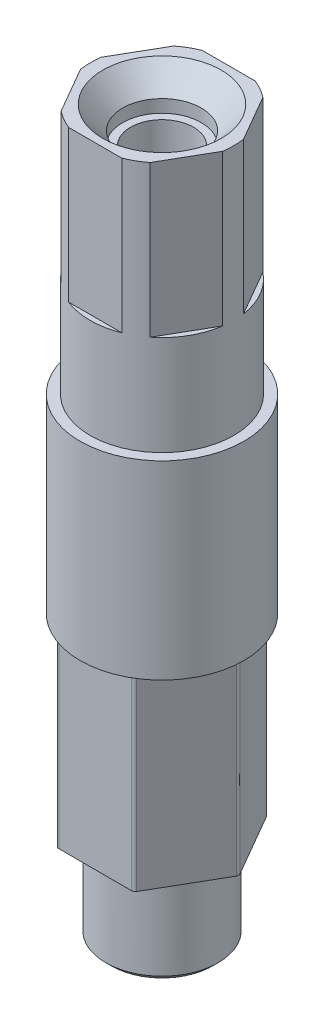
ISO-10303-21;
HEADER;
FILE_DESCRIPTION(('STEP AP214'),'2;1');
FILE_NAME('part.step','',(''),(''),'','','');
FILE_SCHEMA(('AUTOMOTIVE_DESIGN { 1 0 10303 214 1 1 1 1 }'));
ENDSEC;
DATA;
#1=APPLICATION_CONTEXT('core data for automotive mechanical design processes');
#2=APPLICATION_PROTOCOL_DEFINITION('international standard','automotive_design',2000,#1);
#3=PRODUCT_CONTEXT('',#1,'mechanical');
#4=PRODUCT('Part','Part','',(#3));
#5=PRODUCT_RELATED_PRODUCT_CATEGORY('part','',(#4));
#6=PRODUCT_DEFINITION_FORMATION('','',#4);
#7=PRODUCT_DEFINITION_CONTEXT('part definition',#1,'design');
#8=PRODUCT_DEFINITION('design','',#6,#7);
#9=PRODUCT_DEFINITION_SHAPE('','',#8);
#10=(LENGTH_UNIT() NAMED_UNIT(*) SI_UNIT(.MILLI.,.METRE.));
#11=(NAMED_UNIT(*) PLANE_ANGLE_UNIT() SI_UNIT($,.RADIAN.));
#12=(NAMED_UNIT(*) SI_UNIT($,.STERADIAN.) SOLID_ANGLE_UNIT());
#13=UNCERTAINTY_MEASURE_WITH_UNIT(LENGTH_MEASURE(1.E-05),#10,'distance_accuracy_value','');
#14=(GEOMETRIC_REPRESENTATION_CONTEXT(3) GLOBAL_UNCERTAINTY_ASSIGNED_CONTEXT((#13)) GLOBAL_UNIT_ASSIGNED_CONTEXT((#10,
#11,#12)) REPRESENTATION_CONTEXT('',''));
#15=CARTESIAN_POINT('',(0.,0.,0.));
#16=DIRECTION('',(0.,0.,1.));
#17=DIRECTION('',(1.,0.,0.));
#18=AXIS2_PLACEMENT_3D('',#15,#16,#17);
#19=CARTESIAN_POINT('',(0.,34.036,0.));
#20=DIRECTION('',(0.,1.,0.));
#21=DIRECTION('',(0.,0.,1.));
#22=AXIS2_PLACEMENT_3D('',#19,#20,#21);
#23=PLANE('',#22);
#24=CARTESIAN_POINT('',(0.,34.036,0.));
#25=DIRECTION('',(0.,1.,0.));
#26=DIRECTION('',(0.,0.,1.));
#27=AXIS2_PLACEMENT_3D('',#24,#25,#26);
#28=CIRCLE('',#27,5.842);
#29=CARTESIAN_POINT('',(0.,34.036,5.842));
#30=VERTEX_POINT('',#29);
#31=EDGE_CURVE('E406',#30,#30,#28,.T.);
#32=ORIENTED_EDGE('',*,*,#31,.T.);
#33=EDGE_LOOP('',(#32));
#34=FACE_BOUND('',#33,.T.);
#35=CARTESIAN_POINT('',(0.,34.036,0.));
#36=DIRECTION('',(0.,1.,0.));
#37=DIRECTION('',(0.,0.,1.));
#38=AXIS2_PLACEMENT_3D('',#35,#36,#37);
#39=CIRCLE('',#38,5.125);
#40=CARTESIAN_POINT('',(0.,34.036,5.125));
#41=VERTEX_POINT('',#40);
#42=EDGE_CURVE('E265',#41,#41,#39,.T.);
#43=ORIENTED_EDGE('',*,*,#42,.F.);
#44=EDGE_LOOP('',(#43));
#45=FACE_BOUND('',#44,.T.);
#46=ADVANCED_FACE('F16',(#34,#45),#23,.T.);
#47=CARTESIAN_POINT('',(2.7496306570156,52.705,4.7625));
#48=DIRECTION('',(-0.866025403784439,0.,-0.5));
#49=DIRECTION('',(-0.5,0.,0.866025403784439));
#50=AXIS2_PLACEMENT_3D('',#47,#48,#49);
#51=PLANE('',#50);
#52=DIRECTION('',(0.,1.,0.));
#53=VECTOR('',#52,1.);
#54=CARTESIAN_POINT('',(3.1778443335599,34.036,4.02081215572939));
#55=LINE('',#54,#53);
#56=CARTESIAN_POINT('',(3.1778443335599,41.148,4.02081215572939));
#57=VERTEX_POINT('',#56);
#58=CARTESIAN_POINT('',(3.1778443335599,51.943,4.02081215572939));
#59=VERTEX_POINT('',#58);
#60=EDGE_CURVE('E214',#57,#59,#55,.T.);
#61=ORIENTED_EDGE('',*,*,#60,.F.);
#62=DIRECTION('',(-0.5,0.,0.866025403784439));
#63=VECTOR('',#62,1.);
#64=CARTESIAN_POINT('',(3.1778443335599,41.148,4.02081215572938));
#65=LINE('',#64,#63);
#66=CARTESIAN_POINT('',(5.07104763748687,41.148,0.741687844270612));
#67=VERTEX_POINT('',#66);
#68=EDGE_CURVE('E569',#67,#57,#65,.T.);
#69=ORIENTED_EDGE('',*,*,#68,.F.);
#70=DIRECTION('',(0.,1.,0.));
#71=VECTOR('',#70,1.);
#72=CARTESIAN_POINT('',(5.07104763748687,34.036,0.741687844270614));
#73=LINE('',#72,#71);
#74=CARTESIAN_POINT('',(5.07104763748687,51.943,0.741687844270614));
#75=VERTEX_POINT('',#74);
#76=EDGE_CURVE('E211',#75,#67,#73,.F.);
#77=ORIENTED_EDGE('',*,*,#76,.F.);
#78=DIRECTION('',(0.5,0.,-0.866025403784439));
#79=VECTOR('',#78,1.);
#80=CARTESIAN_POINT('',(2.7496306570156,51.943,4.7625));
#81=LINE('',#80,#79);
#82=EDGE_CURVE('E216',#59,#75,#81,.T.);
#83=ORIENTED_EDGE('',*,*,#82,.F.);
#84=EDGE_LOOP('',(#61,#69,#77,#83));
#85=FACE_BOUND('',#84,.T.);
#86=ADVANCED_FACE('F452',(#85),#51,.F.);
#87=CARTESIAN_POINT('',(-2.74963065701559,52.705,4.7625));
#88=DIRECTION('',(0.,0.,-1.));
#89=DIRECTION('',(-1.,0.,0.));
#90=AXIS2_PLACEMENT_3D('',#87,#88,#89);
#91=PLANE('',#90);
#92=DIRECTION('',(0.,1.,0.));
#93=VECTOR('',#92,1.);
#94=CARTESIAN_POINT('',(-1.89320330392697,34.036,4.7625));
#95=LINE('',#94,#93);
#96=CARTESIAN_POINT('',(-1.89320330392697,41.148,4.7625));
#97=VERTEX_POINT('',#96);
#98=CARTESIAN_POINT('',(-1.89320330392697,51.943,4.7625));
#99=VERTEX_POINT('',#98);
#100=EDGE_CURVE('E209',#97,#99,#95,.T.);
#101=ORIENTED_EDGE('',*,*,#100,.F.);
#102=DIRECTION('',(-1.,0.,0.));
#103=VECTOR('',#102,1.);
#104=CARTESIAN_POINT('',(-1.89320330392697,41.148,4.7625));
#105=LINE('',#104,#103);
#106=CARTESIAN_POINT('',(1.89320330392697,41.148,4.7625));
#107=VERTEX_POINT('',#106);
#108=EDGE_CURVE('E557',#107,#97,#105,.T.);
#109=ORIENTED_EDGE('',*,*,#108,.F.);
#110=DIRECTION('',(0.,1.,0.));
#111=VECTOR('',#110,1.);
#112=CARTESIAN_POINT('',(1.89320330392697,34.036,4.7625));
#113=LINE('',#112,#111);
#114=CARTESIAN_POINT('',(1.89320330392697,51.943,4.7625));
#115=VERTEX_POINT('',#114);
#116=EDGE_CURVE('E201',#115,#107,#113,.F.);
#117=ORIENTED_EDGE('',*,*,#116,.F.);
#118=DIRECTION('',(1.,0.,0.));
#119=VECTOR('',#118,1.);
#120=CARTESIAN_POINT('',(-2.74963065701559,51.943,4.7625));
#121=LINE('',#120,#119);
#122=EDGE_CURVE('E233',#99,#115,#121,.T.);
#123=ORIENTED_EDGE('',*,*,#122,.F.);
#124=EDGE_LOOP('',(#101,#109,#117,#123));
#125=FACE_BOUND('',#124,.T.);
#126=ADVANCED_FACE('F459',(#125),#91,.F.);
#127=CARTESIAN_POINT('',(-5.49926131403119,52.705,0.));
#128=DIRECTION('',(0.866025403784439,0.,-0.5));
#129=DIRECTION('',(-0.5,0.,-0.866025403784439));
#130=AXIS2_PLACEMENT_3D('',#127,#128,#129);
#131=PLANE('',#130);
#132=DIRECTION('',(0.,1.,0.));
#133=VECTOR('',#132,1.);
#134=CARTESIAN_POINT('',(-5.07104763748687,34.036,0.741687844270612));
#135=LINE('',#134,#133);
#136=CARTESIAN_POINT('',(-5.07104763748687,41.148,0.741687844270612));
#137=VERTEX_POINT('',#136);
#138=CARTESIAN_POINT('',(-5.07104763748687,51.943,0.741687844270612));
#139=VERTEX_POINT('',#138);
#140=EDGE_CURVE('E193',#137,#139,#135,.T.);
#141=ORIENTED_EDGE('',*,*,#140,.F.);
#142=DIRECTION('',(-0.5,0.,-0.866025403784439));
#143=VECTOR('',#142,1.);
#144=CARTESIAN_POINT('',(-5.07104763748687,41.148,0.74168784427061));
#145=LINE('',#144,#143);
#146=CARTESIAN_POINT('',(-3.1778443335599,41.148,4.02081215572939));
#147=VERTEX_POINT('',#146);
#148=EDGE_CURVE('E182',#147,#137,#145,.T.);
#149=ORIENTED_EDGE('',*,*,#148,.F.);
#150=DIRECTION('',(0.,1.,0.));
#151=VECTOR('',#150,1.);
#152=CARTESIAN_POINT('',(-3.1778443335599,34.036,4.02081215572939));
#153=LINE('',#152,#151);
#154=CARTESIAN_POINT('',(-3.1778443335599,51.943,4.02081215572939));
#155=VERTEX_POINT('',#154);
#156=EDGE_CURVE('E191',#155,#147,#153,.F.);
#157=ORIENTED_EDGE('',*,*,#156,.F.);
#158=DIRECTION('',(0.5,0.,0.866025403784439));
#159=VECTOR('',#158,1.);
#160=CARTESIAN_POINT('',(-5.49926131403119,51.943,0.));
#161=LINE('',#160,#159);
#162=EDGE_CURVE('E236',#139,#155,#161,.T.);
#163=ORIENTED_EDGE('',*,*,#162,.F.);
#164=EDGE_LOOP('',(#141,#149,#157,#163));
#165=FACE_BOUND('',#164,.T.);
#166=ADVANCED_FACE('F189',(#165),#131,.F.);
#167=CARTESIAN_POINT('',(-2.74963065701559,52.705,-4.7625));
#168=DIRECTION('',(0.866025403784439,0.,0.5));
#169=DIRECTION('',(0.5,0.,-0.866025403784439));
#170=AXIS2_PLACEMENT_3D('',#167,#168,#169);
#171=PLANE('',#170);
#172=DIRECTION('',(0.,1.,0.));
#173=VECTOR('',#172,1.);
#174=CARTESIAN_POINT('',(-3.1778443335599,34.036,-4.02081215572939));
#175=LINE('',#174,#173);
#176=CARTESIAN_POINT('',(-3.1778443335599,41.148,-4.02081215572939));
#177=VERTEX_POINT('',#176);
#178=CARTESIAN_POINT('',(-3.1778443335599,51.943,-4.02081215572939));
#179=VERTEX_POINT('',#178);
#180=EDGE_CURVE('E199',#177,#179,#175,.T.);
#181=ORIENTED_EDGE('',*,*,#180,.F.);
#182=DIRECTION('',(0.5,0.,-0.866025403784439));
#183=VECTOR('',#182,1.);
#184=CARTESIAN_POINT('',(-3.1778443335599,41.148,-4.02081215572939));
#185=LINE('',#184,#183);
#186=CARTESIAN_POINT('',(-5.07104763748687,41.148,-0.741687844270614));
#187=VERTEX_POINT('',#186);
#188=EDGE_CURVE('E379',#187,#177,#185,.T.);
#189=ORIENTED_EDGE('',*,*,#188,.F.);
#190=DIRECTION('',(0.,1.,0.));
#191=VECTOR('',#190,1.);
#192=CARTESIAN_POINT('',(-5.07104763748687,34.036,-0.741687844270612));
#193=LINE('',#192,#191);
#194=CARTESIAN_POINT('',(-5.07104763748687,51.943,-0.741687844270611));
#195=VERTEX_POINT('',#194);
#196=EDGE_CURVE('E203',#195,#187,#193,.F.);
#197=ORIENTED_EDGE('',*,*,#196,.F.);
#198=DIRECTION('',(-0.5,0.,0.866025403784439));
#199=VECTOR('',#198,1.);
#200=CARTESIAN_POINT('',(-2.74963065701559,51.943,-4.7625));
#201=LINE('',#200,#199);
#202=EDGE_CURVE('E241',#179,#195,#201,.T.);
#203=ORIENTED_EDGE('',*,*,#202,.F.);
#204=EDGE_LOOP('',(#181,#189,#197,#203));
#205=FACE_BOUND('',#204,.T.);
#206=ADVANCED_FACE('F378',(#205),#171,.F.);
#207=CARTESIAN_POINT('',(2.74963065701559,52.705,-4.7625));
#208=DIRECTION('',(0.,0.,1.));
#209=DIRECTION('',(1.,0.,0.));
#210=AXIS2_PLACEMENT_3D('',#207,#208,#209);
#211=PLANE('',#210);
#212=DIRECTION('',(0.,1.,0.));
#213=VECTOR('',#212,1.);
#214=CARTESIAN_POINT('',(1.89320330392697,34.036,-4.7625));
#215=LINE('',#214,#213);
#216=CARTESIAN_POINT('',(1.89320330392697,41.148,-4.7625));
#217=VERTEX_POINT('',#216);
#218=CARTESIAN_POINT('',(1.89320330392697,51.943,-4.7625));
#219=VERTEX_POINT('',#218);
#220=EDGE_CURVE('E369',#217,#219,#215,.T.);
#221=ORIENTED_EDGE('',*,*,#220,.F.);
#222=DIRECTION('',(1.,0.,0.));
#223=VECTOR('',#222,1.);
#224=CARTESIAN_POINT('',(1.89320330392697,41.148,-4.7625));
#225=LINE('',#224,#223);
#226=CARTESIAN_POINT('',(-1.89320330392697,41.148,-4.7625));
#227=VERTEX_POINT('',#226);
#228=EDGE_CURVE('E347',#227,#217,#225,.T.);
#229=ORIENTED_EDGE('',*,*,#228,.F.);
#230=DIRECTION('',(0.,1.,0.));
#231=VECTOR('',#230,1.);
#232=CARTESIAN_POINT('',(-1.89320330392697,34.036,-4.7625));
#233=LINE('',#232,#231);
#234=CARTESIAN_POINT('',(-1.89320330392697,51.943,-4.7625));
#235=VERTEX_POINT('',#234);
#236=EDGE_CURVE('E366',#235,#227,#233,.F.);
#237=ORIENTED_EDGE('',*,*,#236,.F.);
#238=DIRECTION('',(-1.,0.,0.));
#239=VECTOR('',#238,1.);
#240=CARTESIAN_POINT('',(2.74963065701559,51.943,-4.7625));
#241=LINE('',#240,#239);
#242=EDGE_CURVE('E247',#219,#235,#241,.T.);
#243=ORIENTED_EDGE('',*,*,#242,.F.);
#244=EDGE_LOOP('',(#221,#229,#237,#243));
#245=FACE_BOUND('',#244,.T.);
#246=ADVANCED_FACE('F388',(#245),#211,.F.);
#247=CARTESIAN_POINT('',(5.49926131403119,52.705,0.));
#248=DIRECTION('',(-0.866025403784439,0.,0.5));
#249=DIRECTION('',(0.5,0.,0.866025403784439));
#250=AXIS2_PLACEMENT_3D('',#247,#248,#249);
#251=PLANE('',#250);
#252=DIRECTION('',(0.,1.,0.));
#253=VECTOR('',#252,1.);
#254=CARTESIAN_POINT('',(5.07104763748687,34.036,-0.741687844270618));
#255=LINE('',#254,#253);
#256=CARTESIAN_POINT('',(5.07104763748687,41.148,-0.741687844270615));
#257=VERTEX_POINT('',#256);
#258=CARTESIAN_POINT('',(5.07104763748687,51.943,-0.741687844270618));
#259=VERTEX_POINT('',#258);
#260=EDGE_CURVE('E220',#257,#259,#255,.T.);
#261=ORIENTED_EDGE('',*,*,#260,.F.);
#262=DIRECTION('',(0.5,0.,0.866025403784439));
#263=VECTOR('',#262,1.);
#264=CARTESIAN_POINT('',(5.07104763748687,41.148,-0.741687844270615));
#265=LINE('',#264,#263);
#266=CARTESIAN_POINT('',(3.1778443335599,41.148,-4.02081215572938));
#267=VERTEX_POINT('',#266);
#268=EDGE_CURVE('E392',#267,#257,#265,.T.);
#269=ORIENTED_EDGE('',*,*,#268,.F.);
#270=DIRECTION('',(0.,1.,0.));
#271=VECTOR('',#270,1.);
#272=CARTESIAN_POINT('',(3.1778443335599,34.036,-4.02081215572938));
#273=LINE('',#272,#271);
#274=CARTESIAN_POINT('',(3.1778443335599,51.943,-4.02081215572938));
#275=VERTEX_POINT('',#274);
#276=EDGE_CURVE('E217',#275,#267,#273,.F.);
#277=ORIENTED_EDGE('',*,*,#276,.F.);
#278=DIRECTION('',(-0.5,0.,-0.866025403784439));
#279=VECTOR('',#278,1.);
#280=CARTESIAN_POINT('',(5.49926131403119,51.943,0.));
#281=LINE('',#280,#279);
#282=EDGE_CURVE('E230',#259,#275,#281,.T.);
#283=ORIENTED_EDGE('',*,*,#282,.F.);
#284=EDGE_LOOP('',(#261,#269,#277,#283));
#285=FACE_BOUND('',#284,.T.);
#286=ADVANCED_FACE('F482',(#285),#251,.F.);
#287=CARTESIAN_POINT('',(0.,51.943,0.));
#288=DIRECTION('',(0.,1.,0.));
#289=DIRECTION('',(0.,0.,1.));
#290=AXIS2_PLACEMENT_3D('',#287,#288,#289);
#291=PLANE('',#290);
#292=CARTESIAN_POINT('',(0.,51.943,0.));
#293=DIRECTION('',(0.,1.,0.));
#294=DIRECTION('',(0.,0.,1.));
#295=AXIS2_PLACEMENT_3D('',#292,#293,#294);
#296=CIRCLE('',#295,4.22710350578403);
#297=CARTESIAN_POINT('',(0.,51.943,4.22710350578403));
#298=VERTEX_POINT('',#297);
#299=EDGE_CURVE('E221',#298,#298,#296,.F.);
#300=ORIENTED_EDGE('',*,*,#299,.T.);
#301=EDGE_LOOP('',(#300));
#302=FACE_BOUND('',#301,.T.);
#303=ORIENTED_EDGE('',*,*,#122,.T.);
#304=CARTESIAN_POINT('',(0.,51.943,0.));
#305=DIRECTION('',(0.,1.,0.));
#306=DIRECTION('',(0.,0.,1.));
#307=AXIS2_PLACEMENT_3D('',#304,#305,#306);
#308=CIRCLE('',#307,5.125);
#309=EDGE_CURVE('E260',#115,#59,#308,.T.);
#310=ORIENTED_EDGE('',*,*,#309,.T.);
#311=ORIENTED_EDGE('',*,*,#82,.T.);
#312=CARTESIAN_POINT('',(0.,51.943,0.));
#313=DIRECTION('',(0.,1.,0.));
#314=DIRECTION('',(0.,0.,1.));
#315=AXIS2_PLACEMENT_3D('',#312,#313,#314);
#316=CIRCLE('',#315,5.125);
#317=EDGE_CURVE('E255',#75,#259,#316,.T.);
#318=ORIENTED_EDGE('',*,*,#317,.T.);
#319=ORIENTED_EDGE('',*,*,#282,.T.);
#320=CARTESIAN_POINT('',(0.,51.943,0.));
#321=DIRECTION('',(0.,1.,0.));
#322=DIRECTION('',(0.,0.,1.));
#323=AXIS2_PLACEMENT_3D('',#320,#321,#322);
#324=CIRCLE('',#323,5.125);
#325=EDGE_CURVE('E250',#275,#219,#324,.T.);
#326=ORIENTED_EDGE('',*,*,#325,.T.);
#327=ORIENTED_EDGE('',*,*,#242,.T.);
#328=CARTESIAN_POINT('',(0.,51.943,0.));
#329=DIRECTION('',(0.,1.,0.));
#330=DIRECTION('',(0.,0.,1.));
#331=AXIS2_PLACEMENT_3D('',#328,#329,#330);
#332=CIRCLE('',#331,5.125);
#333=EDGE_CURVE('E244',#235,#179,#332,.T.);
#334=ORIENTED_EDGE('',*,*,#333,.T.);
#335=ORIENTED_EDGE('',*,*,#202,.T.);
#336=CARTESIAN_POINT('',(0.,51.943,0.));
#337=DIRECTION('',(0.,1.,0.));
#338=DIRECTION('',(0.,0.,1.));
#339=AXIS2_PLACEMENT_3D('',#336,#337,#338);
#340=CIRCLE('',#339,5.125);
#341=EDGE_CURVE('E238',#195,#139,#340,.T.);
#342=ORIENTED_EDGE('',*,*,#341,.T.);
#343=ORIENTED_EDGE('',*,*,#162,.T.);
#344=CARTESIAN_POINT('',(0.,51.943,0.));
#345=DIRECTION('',(0.,1.,0.));
#346=DIRECTION('',(0.,0.,1.));
#347=AXIS2_PLACEMENT_3D('',#344,#345,#346);
#348=CIRCLE('',#347,5.125);
#349=EDGE_CURVE('E198',#155,#99,#348,.T.);
#350=ORIENTED_EDGE('',*,*,#349,.T.);
#351=EDGE_LOOP('',(#303,#310,#311,#318,#319,#326,#327,#334,#335,#342,#343,#350));
#352=FACE_BOUND('',#351,.T.);
#353=ADVANCED_FACE('F381',(#302,#352),#291,.T.);
#354=CARTESIAN_POINT('',(0.,52.705,0.));
#355=DIRECTION('',(0.,1.,0.));
#356=DIRECTION('',(0.,0.,1.));
#357=AXIS2_PLACEMENT_3D('',#354,#355,#356);
#358=CONICAL_SURFACE('',#357,4.8895,0.715584993317676);
#359=CARTESIAN_POINT('',(0.,50.3090126814401,0.));
#360=DIRECTION('',(0.,1.,0.));
#361=DIRECTION('',(0.,0.,1.));
#362=AXIS2_PLACEMENT_3D('',#359,#360,#361);
#363=CIRCLE('',#362,2.8067);
#364=CARTESIAN_POINT('',(0.,50.3090126814401,2.8067));
#365=VERTEX_POINT('',#364);
#366=EDGE_CURVE('E266',#365,#365,#363,.F.);
#367=ORIENTED_EDGE('',*,*,#366,.T.);
#368=EDGE_LOOP('',(#367));
#369=FACE_BOUND('',#368,.T.);
#370=ORIENTED_EDGE('',*,*,#299,.F.);
#371=EDGE_LOOP('',(#370));
#372=FACE_BOUND('',#371,.T.);
#373=ADVANCED_FACE('F497',(#369,#372),#358,.F.);
#374=CARTESIAN_POINT('',(0.,34.036,0.));
#375=DIRECTION('',(0.,1.,0.));
#376=DIRECTION('',(0.,0.,1.));
#377=AXIS2_PLACEMENT_3D('',#374,#375,#376);
#378=CYLINDRICAL_SURFACE('',#377,5.125);
#379=ORIENTED_EDGE('',*,*,#42,.T.);
#380=EDGE_LOOP('',(#379));
#381=FACE_BOUND('',#380,.T.);
#382=ORIENTED_EDGE('',*,*,#156,.T.);
#383=CARTESIAN_POINT('',(0.,41.148,0.));
#384=DIRECTION('',(0.,1.,0.));
#385=DIRECTION('',(0.,0.,1.));
#386=AXIS2_PLACEMENT_3D('',#383,#384,#385);
#387=CIRCLE('',#386,5.125);
#388=EDGE_CURVE('E179',#137,#147,#387,.T.);
#389=ORIENTED_EDGE('',*,*,#388,.F.);
#390=ORIENTED_EDGE('',*,*,#140,.T.);
#391=ORIENTED_EDGE('',*,*,#341,.F.);
#392=ORIENTED_EDGE('',*,*,#196,.T.);
#393=CARTESIAN_POINT('',(0.,41.148,0.));
#394=DIRECTION('',(0.,1.,0.));
#395=DIRECTION('',(0.,0.,1.));
#396=AXIS2_PLACEMENT_3D('',#393,#394,#395);
#397=CIRCLE('',#396,5.125);
#398=EDGE_CURVE('E373',#177,#187,#397,.T.);
#399=ORIENTED_EDGE('',*,*,#398,.F.);
#400=ORIENTED_EDGE('',*,*,#180,.T.);
#401=ORIENTED_EDGE('',*,*,#333,.F.);
#402=ORIENTED_EDGE('',*,*,#236,.T.);
#403=CARTESIAN_POINT('',(0.,41.148,0.));
#404=DIRECTION('',(0.,1.,0.));
#405=DIRECTION('',(0.,0.,1.));
#406=AXIS2_PLACEMENT_3D('',#403,#404,#405);
#407=CIRCLE('',#406,5.125);
#408=EDGE_CURVE('E390',#217,#227,#407,.T.);
#409=ORIENTED_EDGE('',*,*,#408,.F.);
#410=ORIENTED_EDGE('',*,*,#220,.T.);
#411=ORIENTED_EDGE('',*,*,#325,.F.);
#412=ORIENTED_EDGE('',*,*,#276,.T.);
#413=CARTESIAN_POINT('',(0.,41.148,0.));
#414=DIRECTION('',(0.,1.,0.));
#415=DIRECTION('',(0.,0.,1.));
#416=AXIS2_PLACEMENT_3D('',#413,#414,#415);
#417=CIRCLE('',#416,5.125);
#418=EDGE_CURVE('E575',#257,#267,#417,.T.);
#419=ORIENTED_EDGE('',*,*,#418,.F.);
#420=ORIENTED_EDGE('',*,*,#260,.T.);
#421=ORIENTED_EDGE('',*,*,#317,.F.);
#422=ORIENTED_EDGE('',*,*,#76,.T.);
#423=CARTESIAN_POINT('',(0.,41.148,0.));
#424=DIRECTION('',(0.,1.,0.));
#425=DIRECTION('',(0.,0.,1.));
#426=AXIS2_PLACEMENT_3D('',#423,#424,#425);
#427=CIRCLE('',#426,5.125);
#428=EDGE_CURVE('E562',#57,#67,#427,.T.);
#429=ORIENTED_EDGE('',*,*,#428,.F.);
#430=ORIENTED_EDGE('',*,*,#60,.T.);
#431=ORIENTED_EDGE('',*,*,#309,.F.);
#432=ORIENTED_EDGE('',*,*,#116,.T.);
#433=CARTESIAN_POINT('',(0.,41.148,0.));
#434=DIRECTION('',(0.,1.,0.));
#435=DIRECTION('',(0.,0.,1.));
#436=AXIS2_PLACEMENT_3D('',#433,#434,#435);
#437=CIRCLE('',#436,5.125);
#438=EDGE_CURVE('E194',#97,#107,#437,.T.);
#439=ORIENTED_EDGE('',*,*,#438,.F.);
#440=ORIENTED_EDGE('',*,*,#100,.T.);
#441=ORIENTED_EDGE('',*,*,#349,.F.);
#442=EDGE_LOOP('',(#382,#389,#390,#391,#392,#399,#400,#401,#402,#409,#410,#411,#412,#419,#420,
#421,#422,#429,#430,#431,#432,#439,#440,#441));
#443=FACE_BOUND('',#442,.T.);
#444=ADVANCED_FACE('F196',(#381,#443),#378,.T.);
#445=CARTESIAN_POINT('',(0.,48.895,0.));
#446=DIRECTION('',(0.,1.,0.));
#447=DIRECTION('',(0.,0.,1.));
#448=AXIS2_PLACEMENT_3D('',#445,#446,#447);
#449=CYLINDRICAL_SURFACE('',#448,2.8067);
#450=CARTESIAN_POINT('',(0.,49.403,0.));
#451=DIRECTION('',(0.,1.,0.));
#452=DIRECTION('',(0.,0.,1.));
#453=AXIS2_PLACEMENT_3D('',#450,#451,#452);
#454=CIRCLE('',#453,2.8067);
#455=CARTESIAN_POINT('',(0.,49.403,2.8067));
#456=VERTEX_POINT('',#455);
#457=EDGE_CURVE('E271',#456,#456,#454,.T.);
#458=ORIENTED_EDGE('',*,*,#457,.F.);
#459=EDGE_LOOP('',(#458));
#460=FACE_BOUND('',#459,.T.);
#461=ORIENTED_EDGE('',*,*,#366,.F.);
#462=EDGE_LOOP('',(#461));
#463=FACE_BOUND('',#462,.T.);
#464=ADVANCED_FACE('F493',(#460,#463),#449,.F.);
#465=CARTESIAN_POINT('',(0.,49.403,0.));
#466=DIRECTION('',(0.,1.,0.));
#467=DIRECTION('',(0.,0.,1.));
#468=AXIS2_PLACEMENT_3D('',#465,#466,#467);
#469=PLANE('',#468);
#470=ORIENTED_EDGE('',*,*,#457,.T.);
#471=EDGE_LOOP('',(#470));
#472=FACE_BOUND('',#471,.T.);
#473=CARTESIAN_POINT('',(0.,49.403,0.));
#474=DIRECTION('',(0.,1.,0.));
#475=DIRECTION('',(0.,0.,1.));
#476=AXIS2_PLACEMENT_3D('',#473,#474,#475);
#477=CIRCLE('',#476,2.2479);
#478=CARTESIAN_POINT('',(0.,49.403,2.2479));
#479=VERTEX_POINT('',#478);
#480=EDGE_CURVE('E270',#479,#479,#477,.F.);
#481=ORIENTED_EDGE('',*,*,#480,.T.);
#482=EDGE_LOOP('',(#481));
#483=FACE_BOUND('',#482,.T.);
#484=ADVANCED_FACE('F489',(#472,#483),#469,.T.);
#485=CARTESIAN_POINT('',(0.,30.988,0.));
#486=DIRECTION('',(0.,1.,0.));
#487=DIRECTION('',(0.,0.,1.));
#488=AXIS2_PLACEMENT_3D('',#485,#486,#487);
#489=CONICAL_SURFACE('',#488,2.2479,1.02974425867665);
#490=CARTESIAN_POINT('',(0.,29.637325414488,0.));
#491=VERTEX_POINT('',#490);
#492=VERTEX_LOOP('',#491);
#493=FACE_BOUND('',#492,.T.);
#494=CARTESIAN_POINT('',(0.,30.988,0.));
#495=DIRECTION('',(0.,1.,0.));
#496=DIRECTION('',(0.,0.,1.));
#497=AXIS2_PLACEMENT_3D('',#494,#495,#496);
#498=CIRCLE('',#497,2.2479);
#499=CARTESIAN_POINT('',(0.,30.988,2.2479));
#500=VERTEX_POINT('',#499);
#501=EDGE_CURVE('E227',#500,#500,#498,.T.);
#502=ORIENTED_EDGE('',*,*,#501,.T.);
#503=EDGE_LOOP('',(#502));
#504=FACE_BOUND('',#503,.T.);
#505=ADVANCED_FACE('F469',(#493,#504),#489,.F.);
#506=CARTESIAN_POINT('',(0.,52.705,0.));
#507=DIRECTION('',(0.,1.,0.));
#508=DIRECTION('',(0.,0.,1.));
#509=AXIS2_PLACEMENT_3D('',#506,#507,#508);
#510=CYLINDRICAL_SURFACE('',#509,2.2479);
#511=ORIENTED_EDGE('',*,*,#501,.F.);
#512=EDGE_LOOP('',(#511));
#513=FACE_BOUND('',#512,.T.);
#514=ORIENTED_EDGE('',*,*,#480,.F.);
#515=EDGE_LOOP('',(#514));
#516=FACE_BOUND('',#515,.T.);
#517=ADVANCED_FACE('F466',(#513,#516),#510,.F.);
#518=CARTESIAN_POINT('',(0.,20.485749986,0.));
#519=DIRECTION('',(0.,1.,0.));
#520=DIRECTION('',(0.,0.,1.));
#521=AXIS2_PLACEMENT_3D('',#518,#519,#520);
#522=CYLINDRICAL_SURFACE('',#521,5.842);
#523=CARTESIAN_POINT('',(0.,20.485749986,0.));
#524=DIRECTION('',(0.,1.,0.));
#525=DIRECTION('',(0.,0.,1.));
#526=AXIS2_PLACEMENT_3D('',#523,#524,#525);
#527=CIRCLE('',#526,5.842);
#528=CARTESIAN_POINT('',(0.,20.485749986,5.842));
#529=VERTEX_POINT('',#528);
#530=EDGE_CURVE('E274',#529,#529,#527,.T.);
#531=ORIENTED_EDGE('',*,*,#530,.T.);
#532=EDGE_LOOP('',(#531));
#533=FACE_BOUND('',#532,.T.);
#534=ORIENTED_EDGE('',*,*,#31,.F.);
#535=EDGE_LOOP('',(#534));
#536=FACE_BOUND('',#535,.T.);
#537=ADVANCED_FACE('F468',(#533,#536),#522,.T.);
#538=CARTESIAN_POINT('',(0.,20.485749986,0.));
#539=DIRECTION('',(0.,1.,0.));
#540=DIRECTION('',(0.,0.,1.));
#541=AXIS2_PLACEMENT_3D('',#538,#539,#540);
#542=PLANE('',#541);
#543=DIRECTION('',(1.,0.,0.));
#544=VECTOR('',#543,1.);
#545=CARTESIAN_POINT('',(-2.74963065701559,20.485749986,4.7625));
#546=LINE('',#545,#544);
#547=CARTESIAN_POINT('',(-2.60298368864142,20.485749986,4.7625));
#548=VERTEX_POINT('',#547);
#549=CARTESIAN_POINT('',(2.60298368864142,20.485749986,4.7625));
#550=VERTEX_POINT('',#549);
#551=EDGE_CURVE('E403',#548,#550,#546,.T.);
#552=ORIENTED_EDGE('',*,*,#551,.T.);
#553=CARTESIAN_POINT('',(2.60298368864143,20.485749986,4.5085));
#554=DIRECTION('',(0.,1.,0.));
#555=DIRECTION('',(0.,0.,1.));
#556=AXIS2_PLACEMENT_3D('',#553,#554,#555);
#557=CIRCLE('',#556,0.254);
#558=CARTESIAN_POINT('',(2.82295414120268,20.485749986,4.6355));
#559=VERTEX_POINT('',#558);
#560=EDGE_CURVE('E323',#550,#559,#557,.T.);
#561=ORIENTED_EDGE('',*,*,#560,.T.);
#562=DIRECTION('',(0.5,0.,-0.866025403784439));
#563=VECTOR('',#562,1.);
#564=CARTESIAN_POINT('',(2.7496306570156,20.485749986,4.7625));
#565=LINE('',#564,#563);
#566=CARTESIAN_POINT('',(5.42593782984411,20.485749986,0.126999999999999));
#567=VERTEX_POINT('',#566);
#568=EDGE_CURVE('E338',#559,#567,#565,.T.);
#569=ORIENTED_EDGE('',*,*,#568,.T.);
#570=CARTESIAN_POINT('',(5.20596737728286,20.485749986,0.));
#571=DIRECTION('',(0.,1.,0.));
#572=DIRECTION('',(0.,0.,1.));
#573=AXIS2_PLACEMENT_3D('',#570,#571,#572);
#574=CIRCLE('',#573,0.254);
#575=CARTESIAN_POINT('',(5.4259378298441,20.485749986,-0.127));
#576=VERTEX_POINT('',#575);
#577=EDGE_CURVE('E329',#567,#576,#574,.T.);
#578=ORIENTED_EDGE('',*,*,#577,.T.);
#579=DIRECTION('',(-0.5,0.,-0.866025403784439));
#580=VECTOR('',#579,1.);
#581=CARTESIAN_POINT('',(5.49926131403119,20.485749986,0.));
#582=LINE('',#581,#580);
#583=CARTESIAN_POINT('',(2.82295414120268,20.485749986,-4.6355));
#584=VERTEX_POINT('',#583);
#585=EDGE_CURVE('E336',#576,#584,#582,.T.);
#586=ORIENTED_EDGE('',*,*,#585,.T.);
#587=CARTESIAN_POINT('',(2.60298368864142,20.485749986,-4.5085));
#588=DIRECTION('',(0.,1.,0.));
#589=DIRECTION('',(0.,0.,1.));
#590=AXIS2_PLACEMENT_3D('',#587,#588,#589);
#591=CIRCLE('',#590,0.254);
#592=CARTESIAN_POINT('',(2.60298368864142,20.485749986,-4.7625));
#593=VERTEX_POINT('',#592);
#594=EDGE_CURVE('E24',#584,#593,#591,.T.);
#595=ORIENTED_EDGE('',*,*,#594,.T.);
#596=DIRECTION('',(-1.,0.,0.));
#597=VECTOR('',#596,1.);
#598=CARTESIAN_POINT('',(2.74963065701559,20.485749986,-4.7625));
#599=LINE('',#598,#597);
#600=CARTESIAN_POINT('',(-2.60298368864142,20.485749986,-4.7625));
#601=VERTEX_POINT('',#600);
#602=EDGE_CURVE('E346',#593,#601,#599,.T.);
#603=ORIENTED_EDGE('',*,*,#602,.T.);
#604=CARTESIAN_POINT('',(-2.60298368864142,20.485749986,-4.5085));
#605=DIRECTION('',(0.,1.,0.));
#606=DIRECTION('',(0.,0.,1.));
#607=AXIS2_PLACEMENT_3D('',#604,#605,#606);
#608=CIRCLE('',#607,0.254);
#609=CARTESIAN_POINT('',(-2.82295414120268,20.485749986,-4.6355));
#610=VERTEX_POINT('',#609);
#611=EDGE_CURVE('E11',#601,#610,#608,.T.);
#612=ORIENTED_EDGE('',*,*,#611,.T.);
#613=DIRECTION('',(-0.5,0.,0.866025403784439));
#614=VECTOR('',#613,1.);
#615=CARTESIAN_POINT('',(-2.7496306570156,20.485749986,-4.7625));
#616=LINE('',#615,#614);
#617=CARTESIAN_POINT('',(-5.4259378298441,20.485749986,-0.127000000000001));
#618=VERTEX_POINT('',#617);
#619=EDGE_CURVE('E397',#610,#618,#616,.T.);
#620=ORIENTED_EDGE('',*,*,#619,.T.);
#621=CARTESIAN_POINT('',(-5.20596737728286,20.485749986,0.));
#622=DIRECTION('',(0.,1.,0.));
#623=DIRECTION('',(0.,0.,1.));
#624=AXIS2_PLACEMENT_3D('',#621,#622,#623);
#625=CIRCLE('',#624,0.254);
#626=CARTESIAN_POINT('',(-5.4259378298441,20.485749986,0.127));
#627=VERTEX_POINT('',#626);
#628=EDGE_CURVE('E327',#618,#627,#625,.T.);
#629=ORIENTED_EDGE('',*,*,#628,.T.);
#630=DIRECTION('',(0.5,0.,0.866025403784439));
#631=VECTOR('',#630,1.);
#632=CARTESIAN_POINT('',(-5.49926131403119,20.485749986,0.));
#633=LINE('',#632,#631);
#634=CARTESIAN_POINT('',(-2.82295414120267,20.485749986,4.6355));
#635=VERTEX_POINT('',#634);
#636=EDGE_CURVE('E400',#627,#635,#633,.T.);
#637=ORIENTED_EDGE('',*,*,#636,.T.);
#638=CARTESIAN_POINT('',(-2.60298368864142,20.485749986,4.5085));
#639=DIRECTION('',(0.,1.,0.));
#640=DIRECTION('',(0.,0.,1.));
#641=AXIS2_PLACEMENT_3D('',#638,#639,#640);
#642=CIRCLE('',#641,0.254);
#643=EDGE_CURVE('E325',#635,#548,#642,.T.);
#644=ORIENTED_EDGE('',*,*,#643,.T.);
#645=EDGE_LOOP('',(#552,#561,#569,#578,#586,#595,#603,#612,#620,#629,#637,#644));
#646=FACE_BOUND('',#645,.T.);
#647=ORIENTED_EDGE('',*,*,#530,.F.);
#648=EDGE_LOOP('',(#647));
#649=FACE_BOUND('',#648,.T.);
#650=ADVANCED_FACE('F334',(#646,#649),#542,.F.);
#651=CARTESIAN_POINT('',(0.,0.508,0.));
#652=DIRECTION('',(0.,1.,0.));
#653=DIRECTION('',(0.,0.,1.));
#654=AXIS2_PLACEMENT_3D('',#651,#652,#653);
#655=PLANE('',#654);
#656=CARTESIAN_POINT('',(0.,0.508,0.));
#657=DIRECTION('',(0.,1.,0.));
#658=DIRECTION('',(0.,0.,1.));
#659=AXIS2_PLACEMENT_3D('',#656,#657,#658);
#660=CIRCLE('',#659,3.619);
#661=CARTESIAN_POINT('',(0.,0.508,3.619));
#662=VERTEX_POINT('',#661);
#663=EDGE_CURVE('E226',#662,#662,#660,.F.);
#664=ORIENTED_EDGE('',*,*,#663,.T.);
#665=EDGE_LOOP('',(#664));
#666=FACE_BOUND('',#665,.T.);
#667=ADVANCED_FACE('F502',(#666),#655,.F.);
#668=CARTESIAN_POINT('',(0.,0.508,0.));
#669=DIRECTION('',(0.,1.,0.));
#670=DIRECTION('',(0.,0.,1.));
#671=AXIS2_PLACEMENT_3D('',#668,#669,#670);
#672=CONICAL_SURFACE('',#671,3.619,0.785398163397437);
#673=CARTESIAN_POINT('',(0.,0.889,0.));
#674=DIRECTION('',(0.,1.,0.));
#675=DIRECTION('',(0.,0.,1.));
#676=AXIS2_PLACEMENT_3D('',#673,#674,#675);
#677=CIRCLE('',#676,4.);
#678=CARTESIAN_POINT('',(0.,0.889,4.));
#679=VERTEX_POINT('',#678);
#680=EDGE_CURVE('E279',#679,#679,#677,.T.);
#681=ORIENTED_EDGE('',*,*,#680,.F.);
#682=EDGE_LOOP('',(#681));
#683=FACE_BOUND('',#682,.T.);
#684=ORIENTED_EDGE('',*,*,#663,.F.);
#685=EDGE_LOOP('',(#684));
#686=FACE_BOUND('',#685,.T.);
#687=ADVANCED_FACE('F504',(#683,#686),#672,.T.);
#688=CARTESIAN_POINT('',(0.,7.023749986,0.));
#689=DIRECTION('',(0.,-1.,0.));
#690=DIRECTION('',(0.,0.,-1.));
#691=AXIS2_PLACEMENT_3D('',#688,#689,#690);
#692=CYLINDRICAL_SURFACE('',#691,4.);
#693=ORIENTED_EDGE('',*,*,#680,.T.);
#694=EDGE_LOOP('',(#693));
#695=FACE_BOUND('',#694,.T.);
#696=CARTESIAN_POINT('',(0.,7.023749986,0.));
#697=DIRECTION('',(0.,-1.,0.));
#698=DIRECTION('',(0.,0.,-1.));
#699=AXIS2_PLACEMENT_3D('',#696,#697,#698);
#700=CIRCLE('',#699,4.);
#701=CARTESIAN_POINT('',(0.,7.023749986,-4.));
#702=VERTEX_POINT('',#701);
#703=EDGE_CURVE('E269',#702,#702,#700,.T.);
#704=ORIENTED_EDGE('',*,*,#703,.T.);
#705=EDGE_LOOP('',(#704));
#706=FACE_BOUND('',#705,.T.);
#707=ADVANCED_FACE('F507',(#695,#706),#692,.T.);
#708=CARTESIAN_POINT('',(0.,7.023749986,0.));
#709=DIRECTION('',(0.,-1.,0.));
#710=DIRECTION('',(0.,0.,-1.));
#711=AXIS2_PLACEMENT_3D('',#708,#709,#710);
#712=PLANE('',#711);
#713=ORIENTED_EDGE('',*,*,#703,.F.);
#714=EDGE_LOOP('',(#713));
#715=FACE_BOUND('',#714,.T.);
#716=DIRECTION('',(-0.5,0.,0.866025403784439));
#717=VECTOR('',#716,1.);
#718=CARTESIAN_POINT('',(2.7496306570156,7.023749986,4.7625));
#719=LINE('',#718,#717);
#720=CARTESIAN_POINT('',(5.4259378298441,7.023749986,0.127));
#721=VERTEX_POINT('',#720);
#722=CARTESIAN_POINT('',(2.82295414120268,7.023749986,4.6355));
#723=VERTEX_POINT('',#722);
#724=EDGE_CURVE('E239',#721,#723,#719,.T.);
#725=ORIENTED_EDGE('',*,*,#724,.T.);
#726=CARTESIAN_POINT('',(2.60298368864143,7.023749986,4.5085));
#727=DIRECTION('',(0.,-1.,0.));
#728=DIRECTION('',(0.,0.,-1.));
#729=AXIS2_PLACEMENT_3D('',#726,#727,#728);
#730=CIRCLE('',#729,0.254);
#731=CARTESIAN_POINT('',(2.60298368864142,7.023749986,4.7625));
#732=VERTEX_POINT('',#731);
#733=EDGE_CURVE('E297',#723,#732,#730,.T.);
#734=ORIENTED_EDGE('',*,*,#733,.T.);
#735=DIRECTION('',(-1.,0.,0.));
#736=VECTOR('',#735,1.);
#737=CARTESIAN_POINT('',(-2.74963065701559,7.023749986,4.7625));
#738=LINE('',#737,#736);
#739=CARTESIAN_POINT('',(-2.60298368864142,7.023749986,4.7625));
#740=VERTEX_POINT('',#739);
#741=EDGE_CURVE('E357',#732,#740,#738,.T.);
#742=ORIENTED_EDGE('',*,*,#741,.T.);
#743=CARTESIAN_POINT('',(-2.60298368864142,7.023749986,4.5085));
#744=DIRECTION('',(0.,-1.,0.));
#745=DIRECTION('',(0.,0.,-1.));
#746=AXIS2_PLACEMENT_3D('',#743,#744,#745);
#747=CIRCLE('',#746,0.254);
#748=CARTESIAN_POINT('',(-2.82295414120267,7.023749986,4.6355));
#749=VERTEX_POINT('',#748);
#750=EDGE_CURVE('E295',#740,#749,#747,.T.);
#751=ORIENTED_EDGE('',*,*,#750,.T.);
#752=DIRECTION('',(-0.5,0.,-0.866025403784439));
#753=VECTOR('',#752,1.);
#754=CARTESIAN_POINT('',(-5.49926131403119,7.023749986,0.));
#755=LINE('',#754,#753);
#756=CARTESIAN_POINT('',(-5.4259378298441,7.023749986,0.127));
#757=VERTEX_POINT('',#756);
#758=EDGE_CURVE('E360',#749,#757,#755,.T.);
#759=ORIENTED_EDGE('',*,*,#758,.T.);
#760=CARTESIAN_POINT('',(-5.20596737728286,7.023749986,0.));
#761=DIRECTION('',(0.,-1.,0.));
#762=DIRECTION('',(0.,0.,-1.));
#763=AXIS2_PLACEMENT_3D('',#760,#761,#762);
#764=CIRCLE('',#763,0.254);
#765=CARTESIAN_POINT('',(-5.4259378298441,7.023749986,-0.127));
#766=VERTEX_POINT('',#765);
#767=EDGE_CURVE('E293',#757,#766,#764,.T.);
#768=ORIENTED_EDGE('',*,*,#767,.T.);
#769=DIRECTION('',(0.5,0.,-0.866025403784439));
#770=VECTOR('',#769,1.);
#771=CARTESIAN_POINT('',(-2.74963065701559,7.023749986,-4.7625));
#772=LINE('',#771,#770);
#773=CARTESIAN_POINT('',(-2.82295414120268,7.023749986,-4.6355));
#774=VERTEX_POINT('',#773);
#775=EDGE_CURVE('E416',#766,#774,#772,.T.);
#776=ORIENTED_EDGE('',*,*,#775,.T.);
#777=CARTESIAN_POINT('',(-2.60298368864142,7.023749986,-4.5085));
#778=DIRECTION('',(0.,-1.,0.));
#779=DIRECTION('',(0.,0.,-1.));
#780=AXIS2_PLACEMENT_3D('',#777,#778,#779);
#781=CIRCLE('',#780,0.254);
#782=CARTESIAN_POINT('',(-2.60298368864142,7.023749986,-4.7625));
#783=VERTEX_POINT('',#782);
#784=EDGE_CURVE('E287',#774,#783,#781,.T.);
#785=ORIENTED_EDGE('',*,*,#784,.T.);
#786=DIRECTION('',(1.,0.,0.));
#787=VECTOR('',#786,1.);
#788=CARTESIAN_POINT('',(2.74963065701559,7.023749986,-4.7625));
#789=LINE('',#788,#787);
#790=CARTESIAN_POINT('',(2.60298368864142,7.023749986,-4.7625));
#791=VERTEX_POINT('',#790);
#792=EDGE_CURVE('E413',#783,#791,#789,.T.);
#793=ORIENTED_EDGE('',*,*,#792,.T.);
#794=CARTESIAN_POINT('',(2.60298368864142,7.023749986,-4.5085));
#795=DIRECTION('',(0.,-1.,0.));
#796=DIRECTION('',(0.,0.,-1.));
#797=AXIS2_PLACEMENT_3D('',#794,#795,#796);
#798=CIRCLE('',#797,0.254);
#799=CARTESIAN_POINT('',(2.82295414120268,7.023749986,-4.6355));
#800=VERTEX_POINT('',#799);
#801=EDGE_CURVE('E289',#791,#800,#798,.T.);
#802=ORIENTED_EDGE('',*,*,#801,.T.);
#803=DIRECTION('',(0.5,0.,0.866025403784439));
#804=VECTOR('',#803,1.);
#805=CARTESIAN_POINT('',(5.49926131403119,7.023749986,0.));
#806=LINE('',#805,#804);
#807=CARTESIAN_POINT('',(5.4259378298441,7.023749986,-0.127));
#808=VERTEX_POINT('',#807);
#809=EDGE_CURVE('E223',#800,#808,#806,.T.);
#810=ORIENTED_EDGE('',*,*,#809,.T.);
#811=CARTESIAN_POINT('',(5.20596737728286,7.023749986,0.));
#812=DIRECTION('',(0.,-1.,0.));
#813=DIRECTION('',(0.,0.,-1.));
#814=AXIS2_PLACEMENT_3D('',#811,#812,#813);
#815=CIRCLE('',#814,0.254);
#816=EDGE_CURVE('E291',#808,#721,#815,.T.);
#817=ORIENTED_EDGE('',*,*,#816,.T.);
#818=EDGE_LOOP('',(#725,#734,#742,#751,#759,#768,#776,#785,#793,#802,#810,#817));
#819=FACE_BOUND('',#818,.T.);
#820=ADVANCED_FACE('F353',(#715,#819),#712,.T.);
#821=ORIENTED_EDGE('',*,*,#585,.F.);
#822=DIRECTION('',(0.,-1.,0.));
#823=VECTOR('',#822,1.);
#824=CARTESIAN_POINT('',(5.4259378298441,52.705,-0.127));
#825=LINE('',#824,#823);
#826=EDGE_CURVE('E316',#576,#808,#825,.T.);
#827=ORIENTED_EDGE('',*,*,#826,.T.);
#828=ORIENTED_EDGE('',*,*,#809,.F.);
#829=DIRECTION('',(0.,-1.,0.));
#830=VECTOR('',#829,1.);
#831=CARTESIAN_POINT('',(2.82295414120268,52.705,-4.6355));
#832=LINE('',#831,#830);
#833=EDGE_CURVE('E314',#800,#584,#832,.F.);
#834=ORIENTED_EDGE('',*,*,#833,.T.);
#835=EDGE_LOOP('',(#821,#827,#828,#834));
#836=FACE_BOUND('',#835,.T.);
#837=ADVANCED_FACE('F343',(#836),#251,.F.);
#838=ORIENTED_EDGE('',*,*,#602,.F.);
#839=DIRECTION('',(0.,-1.,0.));
#840=VECTOR('',#839,1.);
#841=CARTESIAN_POINT('',(2.60298368864142,52.705,-4.7625));
#842=LINE('',#841,#840);
#843=EDGE_CURVE('E320',#593,#791,#842,.T.);
#844=ORIENTED_EDGE('',*,*,#843,.T.);
#845=ORIENTED_EDGE('',*,*,#792,.F.);
#846=DIRECTION('',(0.,-1.,0.));
#847=VECTOR('',#846,1.);
#848=CARTESIAN_POINT('',(-2.60298368864142,52.705,-4.7625));
#849=LINE('',#848,#847);
#850=EDGE_CURVE('E31',#783,#601,#849,.F.);
#851=ORIENTED_EDGE('',*,*,#850,.T.);
#852=EDGE_LOOP('',(#838,#844,#845,#851));
#853=FACE_BOUND('',#852,.T.);
#854=ADVANCED_FACE('F483',(#853),#211,.F.);
#855=ORIENTED_EDGE('',*,*,#775,.F.);
#856=DIRECTION('',(0.,-1.,0.));
#857=VECTOR('',#856,1.);
#858=CARTESIAN_POINT('',(-5.4259378298441,52.705,-0.127));
#859=LINE('',#858,#857);
#860=EDGE_CURVE('E312',#766,#618,#859,.F.);
#861=ORIENTED_EDGE('',*,*,#860,.T.);
#862=ORIENTED_EDGE('',*,*,#619,.F.);
#863=DIRECTION('',(0.,-1.,0.));
#864=VECTOR('',#863,1.);
#865=CARTESIAN_POINT('',(-2.82295414120268,52.705,-4.6355));
#866=LINE('',#865,#864);
#867=EDGE_CURVE('E309',#610,#774,#866,.T.);
#868=ORIENTED_EDGE('',*,*,#867,.T.);
#869=EDGE_LOOP('',(#855,#861,#862,#868));
#870=FACE_BOUND('',#869,.T.);
#871=ADVANCED_FACE('F479',(#870),#171,.F.);
#872=ORIENTED_EDGE('',*,*,#758,.F.);
#873=DIRECTION('',(0.,-1.,0.));
#874=VECTOR('',#873,1.);
#875=CARTESIAN_POINT('',(-2.82295414120267,52.705,4.6355));
#876=LINE('',#875,#874);
#877=EDGE_CURVE('E307',#749,#635,#876,.F.);
#878=ORIENTED_EDGE('',*,*,#877,.T.);
#879=ORIENTED_EDGE('',*,*,#636,.F.);
#880=DIRECTION('',(0.,-1.,0.));
#881=VECTOR('',#880,1.);
#882=CARTESIAN_POINT('',(-5.4259378298441,52.705,0.127));
#883=LINE('',#882,#881);
#884=EDGE_CURVE('E304',#627,#757,#883,.T.);
#885=ORIENTED_EDGE('',*,*,#884,.T.);
#886=EDGE_LOOP('',(#872,#878,#879,#885));
#887=FACE_BOUND('',#886,.T.);
#888=ADVANCED_FACE('F423',(#887),#131,.F.);
#889=ORIENTED_EDGE('',*,*,#741,.F.);
#890=DIRECTION('',(0.,-1.,0.));
#891=VECTOR('',#890,1.);
#892=CARTESIAN_POINT('',(2.60298368864142,52.705,4.7625));
#893=LINE('',#892,#891);
#894=EDGE_CURVE('E302',#732,#550,#893,.F.);
#895=ORIENTED_EDGE('',*,*,#894,.T.);
#896=ORIENTED_EDGE('',*,*,#551,.F.);
#897=DIRECTION('',(0.,-1.,0.));
#898=VECTOR('',#897,1.);
#899=CARTESIAN_POINT('',(-2.60298368864142,52.705,4.7625));
#900=LINE('',#899,#898);
#901=EDGE_CURVE('E299',#548,#740,#900,.T.);
#902=ORIENTED_EDGE('',*,*,#901,.T.);
#903=EDGE_LOOP('',(#889,#895,#896,#902));
#904=FACE_BOUND('',#903,.T.);
#905=ADVANCED_FACE('F434',(#904),#91,.F.);
#906=ORIENTED_EDGE('',*,*,#568,.F.);
#907=DIRECTION('',(0.,-1.,0.));
#908=VECTOR('',#907,1.);
#909=CARTESIAN_POINT('',(2.82295414120268,52.705,4.6355));
#910=LINE('',#909,#908);
#911=EDGE_CURVE('E284',#559,#723,#910,.T.);
#912=ORIENTED_EDGE('',*,*,#911,.T.);
#913=ORIENTED_EDGE('',*,*,#724,.F.);
#914=DIRECTION('',(0.,-1.,0.));
#915=VECTOR('',#914,1.);
#916=CARTESIAN_POINT('',(5.4259378298441,52.705,0.126999999999999));
#917=LINE('',#916,#915);
#918=EDGE_CURVE('E282',#721,#567,#917,.F.);
#919=ORIENTED_EDGE('',*,*,#918,.T.);
#920=EDGE_LOOP('',(#906,#912,#913,#919));
#921=FACE_BOUND('',#920,.T.);
#922=ADVANCED_FACE('F355',(#921),#51,.F.);
#923=CARTESIAN_POINT('',(0.,41.148,0.));
#924=DIRECTION('',(0.,1.,0.));
#925=DIRECTION('',(0.,0.,1.));
#926=AXIS2_PLACEMENT_3D('',#923,#924,#925);
#927=PLANE('',#926);
#928=ORIENTED_EDGE('',*,*,#408,.T.);
#929=ORIENTED_EDGE('',*,*,#228,.T.);
#930=EDGE_LOOP('',(#928,#929));
#931=FACE_BOUND('',#930,.T.);
#932=ADVANCED_FACE('F535',(#931),#927,.T.);
#933=CARTESIAN_POINT('',(0.,41.148,0.));
#934=DIRECTION('',(0.,1.,0.));
#935=DIRECTION('',(0.,0.,1.));
#936=AXIS2_PLACEMENT_3D('',#933,#934,#935);
#937=PLANE('',#936);
#938=ORIENTED_EDGE('',*,*,#418,.T.);
#939=ORIENTED_EDGE('',*,*,#268,.T.);
#940=EDGE_LOOP('',(#938,#939));
#941=FACE_BOUND('',#940,.T.);
#942=ADVANCED_FACE('F538',(#941),#937,.T.);
#943=CARTESIAN_POINT('',(0.,41.148,0.));
#944=DIRECTION('',(0.,1.,0.));
#945=DIRECTION('',(0.,0.,1.));
#946=AXIS2_PLACEMENT_3D('',#943,#944,#945);
#947=PLANE('',#946);
#948=ORIENTED_EDGE('',*,*,#398,.T.);
#949=ORIENTED_EDGE('',*,*,#188,.T.);
#950=EDGE_LOOP('',(#948,#949));
#951=FACE_BOUND('',#950,.T.);
#952=ADVANCED_FACE('F541',(#951),#947,.T.);
#953=CARTESIAN_POINT('',(0.,41.148,0.));
#954=DIRECTION('',(0.,1.,0.));
#955=DIRECTION('',(0.,0.,1.));
#956=AXIS2_PLACEMENT_3D('',#953,#954,#955);
#957=PLANE('',#956);
#958=ORIENTED_EDGE('',*,*,#428,.T.);
#959=ORIENTED_EDGE('',*,*,#68,.T.);
#960=EDGE_LOOP('',(#958,#959));
#961=FACE_BOUND('',#960,.T.);
#962=ADVANCED_FACE('F545',(#961),#957,.T.);
#963=CARTESIAN_POINT('',(0.,41.148,0.));
#964=DIRECTION('',(0.,1.,0.));
#965=DIRECTION('',(0.,0.,1.));
#966=AXIS2_PLACEMENT_3D('',#963,#964,#965);
#967=PLANE('',#966);
#968=ORIENTED_EDGE('',*,*,#438,.T.);
#969=ORIENTED_EDGE('',*,*,#108,.T.);
#970=EDGE_LOOP('',(#968,#969));
#971=FACE_BOUND('',#970,.T.);
#972=ADVANCED_FACE('F448',(#971),#967,.T.);
#973=CARTESIAN_POINT('',(0.,41.148,0.));
#974=DIRECTION('',(0.,1.,0.));
#975=DIRECTION('',(0.,0.,1.));
#976=AXIS2_PLACEMENT_3D('',#973,#974,#975);
#977=PLANE('',#976);
#978=ORIENTED_EDGE('',*,*,#388,.T.);
#979=ORIENTED_EDGE('',*,*,#148,.T.);
#980=EDGE_LOOP('',(#978,#979));
#981=FACE_BOUND('',#980,.T.);
#982=ADVANCED_FACE('F181',(#981),#977,.T.);
#983=CARTESIAN_POINT('',(2.60298368864143,52.705,4.5085));
#984=DIRECTION('',(0.,-1.,0.));
#985=DIRECTION('',(0.,0.,-1.));
#986=AXIS2_PLACEMENT_3D('',#983,#984,#985);
#987=CYLINDRICAL_SURFACE('',#986,0.254);
#988=ORIENTED_EDGE('',*,*,#560,.F.);
#989=ORIENTED_EDGE('',*,*,#894,.F.);
#990=ORIENTED_EDGE('',*,*,#733,.F.);
#991=ORIENTED_EDGE('',*,*,#911,.F.);
#992=EDGE_LOOP('',(#988,#989,#990,#991));
#993=FACE_BOUND('',#992,.T.);
#994=ADVANCED_FACE('F437',(#993),#987,.T.);
#995=CARTESIAN_POINT('',(-2.60298368864142,52.705,4.5085));
#996=DIRECTION('',(0.,-1.,0.));
#997=DIRECTION('',(0.,0.,-1.));
#998=AXIS2_PLACEMENT_3D('',#995,#996,#997);
#999=CYLINDRICAL_SURFACE('',#998,0.254);
#1000=ORIENTED_EDGE('',*,*,#643,.F.);
#1001=ORIENTED_EDGE('',*,*,#877,.F.);
#1002=ORIENTED_EDGE('',*,*,#750,.F.);
#1003=ORIENTED_EDGE('',*,*,#901,.F.);
#1004=EDGE_LOOP('',(#1000,#1001,#1002,#1003));
#1005=FACE_BOUND('',#1004,.T.);
#1006=ADVANCED_FACE('F428',(#1005),#999,.T.);
#1007=CARTESIAN_POINT('',(-5.20596737728286,52.705,0.));
#1008=DIRECTION('',(0.,-1.,0.));
#1009=DIRECTION('',(0.,0.,-1.));
#1010=AXIS2_PLACEMENT_3D('',#1007,#1008,#1009);
#1011=CYLINDRICAL_SURFACE('',#1010,0.254);
#1012=ORIENTED_EDGE('',*,*,#628,.F.);
#1013=ORIENTED_EDGE('',*,*,#860,.F.);
#1014=ORIENTED_EDGE('',*,*,#767,.F.);
#1015=ORIENTED_EDGE('',*,*,#884,.F.);
#1016=EDGE_LOOP('',(#1012,#1013,#1014,#1015));
#1017=FACE_BOUND('',#1016,.T.);
#1018=ADVANCED_FACE('F446',(#1017),#1011,.T.);
#1019=CARTESIAN_POINT('',(5.20596737728286,52.705,0.));
#1020=DIRECTION('',(0.,-1.,0.));
#1021=DIRECTION('',(0.,0.,-1.));
#1022=AXIS2_PLACEMENT_3D('',#1019,#1020,#1021);
#1023=CYLINDRICAL_SURFACE('',#1022,0.254);
#1024=ORIENTED_EDGE('',*,*,#577,.F.);
#1025=ORIENTED_EDGE('',*,*,#918,.F.);
#1026=ORIENTED_EDGE('',*,*,#816,.F.);
#1027=ORIENTED_EDGE('',*,*,#826,.F.);
#1028=EDGE_LOOP('',(#1024,#1025,#1026,#1027));
#1029=FACE_BOUND('',#1028,.T.);
#1030=ADVANCED_FACE('F349',(#1029),#1023,.T.);
#1031=CARTESIAN_POINT('',(2.60298368864142,52.705,-4.5085));
#1032=DIRECTION('',(0.,-1.,0.));
#1033=DIRECTION('',(0.,0.,-1.));
#1034=AXIS2_PLACEMENT_3D('',#1031,#1032,#1033);
#1035=CYLINDRICAL_SURFACE('',#1034,0.254);
#1036=ORIENTED_EDGE('',*,*,#594,.F.);
#1037=ORIENTED_EDGE('',*,*,#833,.F.);
#1038=ORIENTED_EDGE('',*,*,#801,.F.);
#1039=ORIENTED_EDGE('',*,*,#843,.F.);
#1040=EDGE_LOOP('',(#1036,#1037,#1038,#1039));
#1041=FACE_BOUND('',#1040,.T.);
#1042=ADVANCED_FACE('F623',(#1041),#1035,.T.);
#1043=CARTESIAN_POINT('',(-2.60298368864142,52.705,-4.5085));
#1044=DIRECTION('',(0.,-1.,0.));
#1045=DIRECTION('',(0.,0.,-1.));
#1046=AXIS2_PLACEMENT_3D('',#1043,#1044,#1045);
#1047=CYLINDRICAL_SURFACE('',#1046,0.254);
#1048=ORIENTED_EDGE('',*,*,#611,.F.);
#1049=ORIENTED_EDGE('',*,*,#850,.F.);
#1050=ORIENTED_EDGE('',*,*,#784,.F.);
#1051=ORIENTED_EDGE('',*,*,#867,.F.);
#1052=EDGE_LOOP('',(#1048,#1049,#1050,#1051));
#1053=FACE_BOUND('',#1052,.T.);
#1054=ADVANCED_FACE('F18',(#1053),#1047,.T.);
#1055=CLOSED_SHELL('',(#46,#86,#126,#166,#206,#246,#286,#353,#373,#444,#464,#484,#505,#517,#537,
#650,#667,#687,#707,#820,#837,#854,#871,#888,#905,#922,#932,#942,#952,#962,#972,#982,#994,#1006,
#1018,#1030,#1042,#1054));
#1056=MANIFOLD_SOLID_BREP('B1',#1055);
#1057=ADVANCED_BREP_SHAPE_REPRESENTATION('',(#18,#1056),#14);
#1058=SHAPE_DEFINITION_REPRESENTATION(#9,#1057);
ENDSEC;
END-ISO-10303-21;
